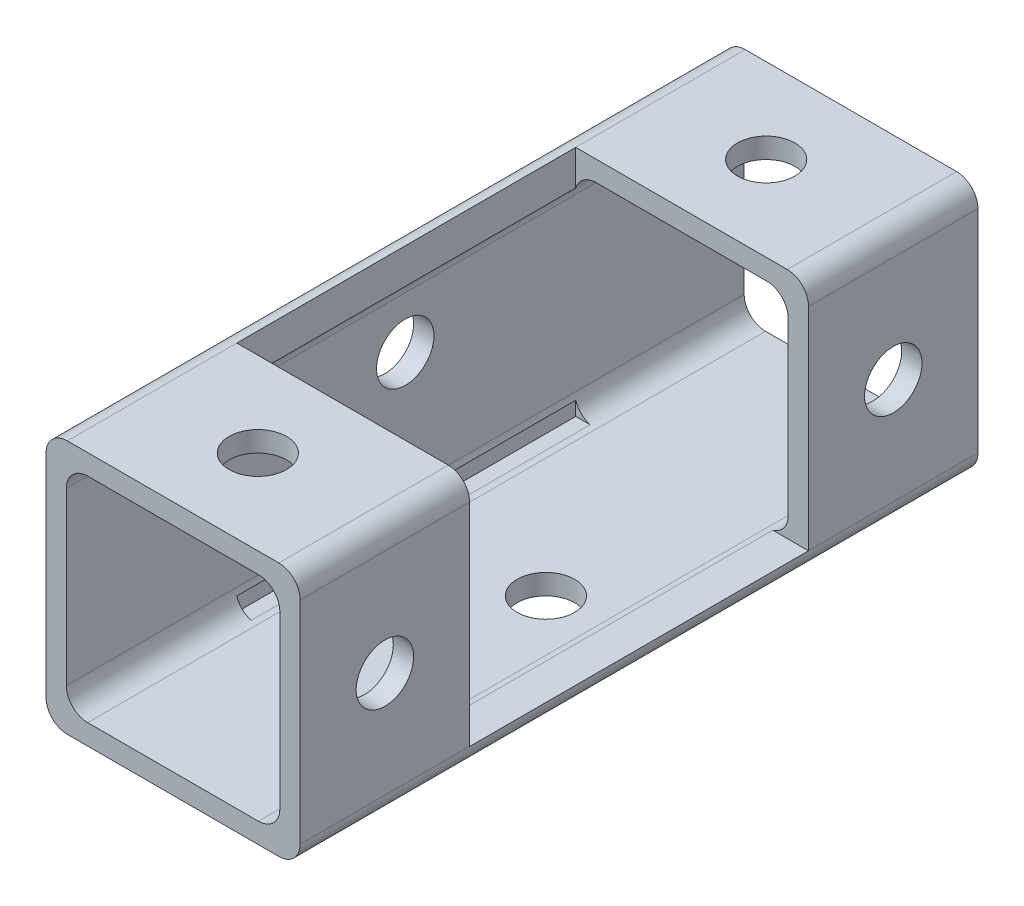
ISO-10303-21;
HEADER;
FILE_DESCRIPTION(('STEP AP214'),'2;1');
FILE_NAME('part.step','',(''),(''),'','','');
FILE_SCHEMA(('AUTOMOTIVE_DESIGN { 1 0 10303 214 1 1 1 1 }'));
ENDSEC;
DATA;
#1=APPLICATION_CONTEXT('core data for automotive mechanical design processes');
#2=APPLICATION_PROTOCOL_DEFINITION('international standard','automotive_design',2000,#1);
#3=PRODUCT_CONTEXT('',#1,'mechanical');
#4=PRODUCT('Part','Part','',(#3));
#5=PRODUCT_RELATED_PRODUCT_CATEGORY('part','',(#4));
#6=PRODUCT_DEFINITION_FORMATION('','',#4);
#7=PRODUCT_DEFINITION_CONTEXT('part definition',#1,'design');
#8=PRODUCT_DEFINITION('design','',#6,#7);
#9=PRODUCT_DEFINITION_SHAPE('','',#8);
#10=(LENGTH_UNIT() NAMED_UNIT(*) SI_UNIT(.MILLI.,.METRE.));
#11=(NAMED_UNIT(*) PLANE_ANGLE_UNIT() SI_UNIT($,.RADIAN.));
#12=(NAMED_UNIT(*) SI_UNIT($,.STERADIAN.) SOLID_ANGLE_UNIT());
#13=UNCERTAINTY_MEASURE_WITH_UNIT(LENGTH_MEASURE(1.E-05),#10,'distance_accuracy_value','');
#14=(GEOMETRIC_REPRESENTATION_CONTEXT(3) GLOBAL_UNCERTAINTY_ASSIGNED_CONTEXT((#13)) GLOBAL_UNIT_ASSIGNED_CONTEXT((#10,
#11,#12)) REPRESENTATION_CONTEXT('',''));
#15=CARTESIAN_POINT('',(0.,0.,0.));
#16=DIRECTION('',(0.,0.,1.));
#17=DIRECTION('',(1.,0.,0.));
#18=AXIS2_PLACEMENT_3D('',#15,#16,#17);
#19=CARTESIAN_POINT('',(9.525,-9.525,25.4));
#20=DIRECTION('',(-1.,0.,0.));
#21=DIRECTION('',(0.,0.,1.));
#22=AXIS2_PLACEMENT_3D('',#19,#20,#21);
#23=PLANE('',#22);
#24=CARTESIAN_POINT('',(9.525,0.,19.05));
#25=DIRECTION('',(1.,0.,0.));
#26=DIRECTION('',(0.,0.,-1.));
#27=AXIS2_PLACEMENT_3D('',#24,#25,#26);
#28=CIRCLE('',#27,2.15265);
#29=CARTESIAN_POINT('',(9.525,0.,16.89735));
#30=VERTEX_POINT('',#29);
#31=EDGE_CURVE('E471',#30,#30,#28,.T.);
#32=ORIENTED_EDGE('',*,*,#31,.F.);
#33=EDGE_LOOP('',(#32));
#34=FACE_BOUND('',#33,.T.);
#35=DIRECTION('',(0.,0.,-1.));
#36=VECTOR('',#35,1.);
#37=CARTESIAN_POINT('',(9.525,-7.9248,25.4));
#38=LINE('',#37,#36);
#39=CARTESIAN_POINT('',(9.525,-7.9248,25.4));
#40=VERTEX_POINT('',#39);
#41=CARTESIAN_POINT('',(9.525,-7.9248,12.7));
#42=VERTEX_POINT('',#41);
#43=EDGE_CURVE('E432',#40,#42,#38,.T.);
#44=ORIENTED_EDGE('',*,*,#43,.T.);
#45=DIRECTION('',(0.,1.,0.));
#46=VECTOR('',#45,1.);
#47=CARTESIAN_POINT('',(9.525,-9.525,12.7));
#48=LINE('',#47,#46);
#49=CARTESIAN_POINT('',(9.525,7.9248,12.7));
#50=VERTEX_POINT('',#49);
#51=EDGE_CURVE('E297',#42,#50,#48,.T.);
#52=ORIENTED_EDGE('',*,*,#51,.T.);
#53=DIRECTION('',(0.,0.,-1.));
#54=VECTOR('',#53,1.);
#55=CARTESIAN_POINT('',(9.525,7.9248,25.4));
#56=LINE('',#55,#54);
#57=CARTESIAN_POINT('',(9.525,7.92479999999999,25.4));
#58=VERTEX_POINT('',#57);
#59=EDGE_CURVE('E427',#50,#58,#56,.F.);
#60=ORIENTED_EDGE('',*,*,#59,.T.);
#61=DIRECTION('',(0.,1.,0.));
#62=VECTOR('',#61,1.);
#63=CARTESIAN_POINT('',(9.525,-9.525,25.4));
#64=LINE('',#63,#62);
#65=EDGE_CURVE('E363',#40,#58,#64,.T.);
#66=ORIENTED_EDGE('',*,*,#65,.F.);
#67=EDGE_LOOP('',(#44,#52,#60,#66));
#68=FACE_BOUND('',#67,.T.);
#69=ADVANCED_FACE('F43',(#34,#68),#23,.F.);
#70=CARTESIAN_POINT('',(-9.525,9.525,25.4));
#71=DIRECTION('',(0.,-1.,0.));
#72=DIRECTION('',(0.,0.,-1.));
#73=AXIS2_PLACEMENT_3D('',#70,#71,#72);
#74=PLANE('',#73);
#75=CARTESIAN_POINT('',(0.,9.525,19.05));
#76=DIRECTION('',(0.,1.,0.));
#77=DIRECTION('',(0.,0.,1.));
#78=AXIS2_PLACEMENT_3D('',#75,#76,#77);
#79=CIRCLE('',#78,2.15265);
#80=CARTESIAN_POINT('',(0.,9.525,21.20265));
#81=VERTEX_POINT('',#80);
#82=EDGE_CURVE('E482',#81,#81,#79,.T.);
#83=ORIENTED_EDGE('',*,*,#82,.F.);
#84=EDGE_LOOP('',(#83));
#85=FACE_BOUND('',#84,.T.);
#86=DIRECTION('',(0.,0.,-1.));
#87=VECTOR('',#86,1.);
#88=CARTESIAN_POINT('',(7.9248,9.525,25.4));
#89=LINE('',#88,#87);
#90=CARTESIAN_POINT('',(7.9248,9.525,25.4));
#91=VERTEX_POINT('',#90);
#92=CARTESIAN_POINT('',(7.9248,9.525,12.7));
#93=VERTEX_POINT('',#92);
#94=EDGE_CURVE('E436',#91,#93,#89,.T.);
#95=ORIENTED_EDGE('',*,*,#94,.T.);
#96=DIRECTION('',(1.,0.,0.));
#97=VECTOR('',#96,1.);
#98=CARTESIAN_POINT('',(-7.9248,9.525,12.7));
#99=LINE('',#98,#97);
#100=CARTESIAN_POINT('',(-7.9248,9.525,12.7));
#101=VERTEX_POINT('',#100);
#102=EDGE_CURVE('E250',#101,#93,#99,.T.);
#103=ORIENTED_EDGE('',*,*,#102,.F.);
#104=DIRECTION('',(0.,0.,-1.));
#105=VECTOR('',#104,1.);
#106=CARTESIAN_POINT('',(-7.9248,9.525,25.4));
#107=LINE('',#106,#105);
#108=CARTESIAN_POINT('',(-7.9248,9.525,25.4));
#109=VERTEX_POINT('',#108);
#110=EDGE_CURVE('E439',#101,#109,#107,.F.);
#111=ORIENTED_EDGE('',*,*,#110,.T.);
#112=DIRECTION('',(-1.,0.,0.));
#113=VECTOR('',#112,1.);
#114=CARTESIAN_POINT('',(-9.525,9.525,25.4));
#115=LINE('',#114,#113);
#116=EDGE_CURVE('E366',#91,#109,#115,.T.);
#117=ORIENTED_EDGE('',*,*,#116,.F.);
#118=EDGE_LOOP('',(#95,#103,#111,#117));
#119=FACE_BOUND('',#118,.T.);
#120=ADVANCED_FACE('F492',(#85,#119),#74,.F.);
#121=CARTESIAN_POINT('',(8.001,-8.001,25.4));
#122=DIRECTION('',(-1.,0.,0.));
#123=DIRECTION('',(0.,0.,1.));
#124=AXIS2_PLACEMENT_3D('',#121,#122,#123);
#125=PLANE('',#124);
#126=CARTESIAN_POINT('',(8.001,0.,19.05));
#127=DIRECTION('',(-1.,0.,0.));
#128=DIRECTION('',(0.,0.,1.));
#129=AXIS2_PLACEMENT_3D('',#126,#127,#128);
#130=CIRCLE('',#129,2.15265);
#131=CARTESIAN_POINT('',(8.001,0.,21.20265));
#132=VERTEX_POINT('',#131);
#133=EDGE_CURVE('E470',#132,#132,#130,.T.);
#134=ORIENTED_EDGE('',*,*,#133,.F.);
#135=EDGE_LOOP('',(#134));
#136=FACE_BOUND('',#135,.T.);
#137=DIRECTION('',(0.,1.,0.));
#138=VECTOR('',#137,1.);
#139=CARTESIAN_POINT('',(8.001,-8.001,12.7));
#140=LINE('',#139,#138);
#141=CARTESIAN_POINT('',(8.001,-6.4008,12.7));
#142=VERTEX_POINT('',#141);
#143=CARTESIAN_POINT('',(8.001,6.4008,12.7));
#144=VERTEX_POINT('',#143);
#145=EDGE_CURVE('E307',#142,#144,#140,.T.);
#146=ORIENTED_EDGE('',*,*,#145,.F.);
#147=DIRECTION('',(0.,0.,-1.));
#148=VECTOR('',#147,1.);
#149=CARTESIAN_POINT('',(8.001,-6.4008,25.4));
#150=LINE('',#149,#148);
#151=CARTESIAN_POINT('',(8.001,-6.4008,25.4));
#152=VERTEX_POINT('',#151);
#153=EDGE_CURVE('E389',#142,#152,#150,.F.);
#154=ORIENTED_EDGE('',*,*,#153,.T.);
#155=DIRECTION('',(0.,1.,0.));
#156=VECTOR('',#155,1.);
#157=CARTESIAN_POINT('',(8.001,-8.001,25.4));
#158=LINE('',#157,#156);
#159=CARTESIAN_POINT('',(8.001,6.4008,25.4));
#160=VERTEX_POINT('',#159);
#161=EDGE_CURVE('E351',#152,#160,#158,.T.);
#162=ORIENTED_EDGE('',*,*,#161,.T.);
#163=DIRECTION('',(0.,0.,-1.));
#164=VECTOR('',#163,1.);
#165=CARTESIAN_POINT('',(8.001,6.4008,-25.4));
#166=LINE('',#165,#164);
#167=EDGE_CURVE('E386',#160,#144,#166,.T.);
#168=ORIENTED_EDGE('',*,*,#167,.T.);
#169=EDGE_LOOP('',(#146,#154,#162,#168));
#170=FACE_BOUND('',#169,.T.);
#171=ADVANCED_FACE('F495',(#136,#170),#125,.T.);
#172=CARTESIAN_POINT('',(-8.001,8.001,25.4));
#173=DIRECTION('',(0.,-1.,0.));
#174=DIRECTION('',(0.,0.,-1.));
#175=AXIS2_PLACEMENT_3D('',#172,#173,#174);
#176=PLANE('',#175);
#177=CARTESIAN_POINT('',(0.,8.001,19.05));
#178=DIRECTION('',(0.,-1.,0.));
#179=DIRECTION('',(0.,0.,-1.));
#180=AXIS2_PLACEMENT_3D('',#177,#178,#179);
#181=CIRCLE('',#180,2.15265);
#182=CARTESIAN_POINT('',(0.,8.001,16.89735));
#183=VERTEX_POINT('',#182);
#184=EDGE_CURVE('E275',#183,#183,#181,.T.);
#185=ORIENTED_EDGE('',*,*,#184,.F.);
#186=EDGE_LOOP('',(#185));
#187=FACE_BOUND('',#186,.T.);
#188=DIRECTION('',(-1.,0.,0.));
#189=VECTOR('',#188,1.);
#190=CARTESIAN_POINT('',(-8.001,8.001,12.7));
#191=LINE('',#190,#189);
#192=CARTESIAN_POINT('',(6.4008,8.001,12.7));
#193=VERTEX_POINT('',#192);
#194=CARTESIAN_POINT('',(-6.4008,8.001,12.7));
#195=VERTEX_POINT('',#194);
#196=EDGE_CURVE('E305',#193,#195,#191,.T.);
#197=ORIENTED_EDGE('',*,*,#196,.F.);
#198=DIRECTION('',(0.,0.,-1.));
#199=VECTOR('',#198,1.);
#200=CARTESIAN_POINT('',(6.4008,8.001,25.4));
#201=LINE('',#200,#199);
#202=CARTESIAN_POINT('',(6.4008,8.001,25.4));
#203=VERTEX_POINT('',#202);
#204=EDGE_CURVE('E393',#193,#203,#201,.F.);
#205=ORIENTED_EDGE('',*,*,#204,.T.);
#206=DIRECTION('',(-1.,0.,0.));
#207=VECTOR('',#206,1.);
#208=CARTESIAN_POINT('',(-8.001,8.001,25.4));
#209=LINE('',#208,#207);
#210=CARTESIAN_POINT('',(-6.4008,8.001,25.4));
#211=VERTEX_POINT('',#210);
#212=EDGE_CURVE('E354',#203,#211,#209,.T.);
#213=ORIENTED_EDGE('',*,*,#212,.T.);
#214=DIRECTION('',(0.,0.,-1.));
#215=VECTOR('',#214,1.);
#216=CARTESIAN_POINT('',(-6.4008,8.001,-25.4));
#217=LINE('',#216,#215);
#218=EDGE_CURVE('E398',#211,#195,#217,.T.);
#219=ORIENTED_EDGE('',*,*,#218,.T.);
#220=EDGE_LOOP('',(#197,#205,#213,#219));
#221=FACE_BOUND('',#220,.T.);
#222=ADVANCED_FACE('F538',(#187,#221),#176,.T.);
#223=CARTESIAN_POINT('',(6.4008,6.4008,25.4));
#224=DIRECTION('',(0.,0.,1.));
#225=DIRECTION('',(1.,0.,0.));
#226=AXIS2_PLACEMENT_3D('',#223,#224,#225);
#227=CYLINDRICAL_SURFACE('',#226,1.6002);
#228=ORIENTED_EDGE('',*,*,#204,.F.);
#229=CARTESIAN_POINT('',(6.4008,6.4008,12.7));
#230=DIRECTION('',(0.,0.,1.));
#231=DIRECTION('',(1.,0.,0.));
#232=AXIS2_PLACEMENT_3D('',#229,#230,#231);
#233=CIRCLE('',#232,1.6002);
#234=EDGE_CURVE('E302',#193,#144,#233,.F.);
#235=ORIENTED_EDGE('',*,*,#234,.T.);
#236=ORIENTED_EDGE('',*,*,#167,.F.);
#237=CARTESIAN_POINT('',(6.4008,6.4008,25.4));
#238=DIRECTION('',(0.,0.,-1.));
#239=DIRECTION('',(-1.,0.,0.));
#240=AXIS2_PLACEMENT_3D('',#237,#238,#239);
#241=CIRCLE('',#240,1.6002);
#242=EDGE_CURVE('E457',#203,#160,#241,.T.);
#243=ORIENTED_EDGE('',*,*,#242,.F.);
#244=EDGE_LOOP('',(#228,#235,#236,#243));
#245=FACE_BOUND('',#244,.T.);
#246=ADVANCED_FACE('F535',(#245),#227,.F.);
#247=CARTESIAN_POINT('',(7.9248,7.9248,25.4));
#248=DIRECTION('',(0.,0.,-1.));
#249=DIRECTION('',(-1.,0.,0.));
#250=AXIS2_PLACEMENT_3D('',#247,#248,#249);
#251=CYLINDRICAL_SURFACE('',#250,1.6002);
#252=CARTESIAN_POINT('',(7.9248,7.9248,12.7));
#253=DIRECTION('',(0.,0.,1.));
#254=DIRECTION('',(1.,0.,0.));
#255=AXIS2_PLACEMENT_3D('',#252,#253,#254);
#256=CIRCLE('',#255,1.6002);
#257=EDGE_CURVE('E52',#93,#50,#256,.F.);
#258=ORIENTED_EDGE('',*,*,#257,.F.);
#259=ORIENTED_EDGE('',*,*,#94,.F.);
#260=CARTESIAN_POINT('',(7.9248,7.9248,25.4));
#261=DIRECTION('',(0.,0.,-1.));
#262=DIRECTION('',(-1.,0.,0.));
#263=AXIS2_PLACEMENT_3D('',#260,#261,#262);
#264=CIRCLE('',#263,1.6002);
#265=EDGE_CURVE('E419',#58,#91,#264,.F.);
#266=ORIENTED_EDGE('',*,*,#265,.F.);
#267=ORIENTED_EDGE('',*,*,#59,.F.);
#268=EDGE_LOOP('',(#258,#259,#266,#267));
#269=FACE_BOUND('',#268,.T.);
#270=ADVANCED_FACE('F505',(#269),#251,.T.);
#271=CARTESIAN_POINT('',(0.,0.,25.4));
#272=DIRECTION('',(0.,0.,-1.));
#273=DIRECTION('',(-1.,0.,0.));
#274=AXIS2_PLACEMENT_3D('',#271,#272,#273);
#275=PLANE('',#274);
#276=DIRECTION('',(0.,-1.,0.));
#277=VECTOR('',#276,1.);
#278=CARTESIAN_POINT('',(-9.525,-9.525,25.4));
#279=LINE('',#278,#277);
#280=CARTESIAN_POINT('',(-9.525,7.92479999999999,25.4));
#281=VERTEX_POINT('',#280);
#282=CARTESIAN_POINT('',(-9.525,-7.9248,25.4));
#283=VERTEX_POINT('',#282);
#284=EDGE_CURVE('E369',#281,#283,#279,.T.);
#285=ORIENTED_EDGE('',*,*,#284,.T.);
#286=CARTESIAN_POINT('',(-7.9248,-7.9248,25.4));
#287=DIRECTION('',(0.,0.,-1.));
#288=DIRECTION('',(-1.,0.,0.));
#289=AXIS2_PLACEMENT_3D('',#286,#287,#288);
#290=CIRCLE('',#289,1.6002);
#291=CARTESIAN_POINT('',(-7.9248,-9.525,25.4));
#292=VERTEX_POINT('',#291);
#293=EDGE_CURVE('E425',#283,#292,#290,.F.);
#294=ORIENTED_EDGE('',*,*,#293,.T.);
#295=DIRECTION('',(1.,0.,0.));
#296=VECTOR('',#295,1.);
#297=CARTESIAN_POINT('',(-9.525,-9.525,25.4));
#298=LINE('',#297,#296);
#299=CARTESIAN_POINT('',(7.9248,-9.525,25.4));
#300=VERTEX_POINT('',#299);
#301=EDGE_CURVE('E372',#292,#300,#298,.T.);
#302=ORIENTED_EDGE('',*,*,#301,.T.);
#303=CARTESIAN_POINT('',(7.9248,-7.9248,25.4));
#304=DIRECTION('',(0.,0.,-1.));
#305=DIRECTION('',(-1.,0.,0.));
#306=AXIS2_PLACEMENT_3D('',#303,#304,#305);
#307=CIRCLE('',#306,1.6002);
#308=EDGE_CURVE('E423',#300,#40,#307,.F.);
#309=ORIENTED_EDGE('',*,*,#308,.T.);
#310=ORIENTED_EDGE('',*,*,#65,.T.);
#311=ORIENTED_EDGE('',*,*,#265,.T.);
#312=ORIENTED_EDGE('',*,*,#116,.T.);
#313=CARTESIAN_POINT('',(-7.9248,7.9248,25.4));
#314=DIRECTION('',(0.,0.,-1.));
#315=DIRECTION('',(-1.,0.,0.));
#316=AXIS2_PLACEMENT_3D('',#313,#314,#315);
#317=CIRCLE('',#316,1.6002);
#318=EDGE_CURVE('E421',#109,#281,#317,.F.);
#319=ORIENTED_EDGE('',*,*,#318,.T.);
#320=EDGE_LOOP('',(#285,#294,#302,#309,#310,#311,#312,#319));
#321=FACE_BOUND('',#320,.T.);
#322=ORIENTED_EDGE('',*,*,#161,.F.);
#323=CARTESIAN_POINT('',(6.4008,-6.4008,25.4));
#324=DIRECTION('',(0.,0.,-1.));
#325=DIRECTION('',(-1.,0.,0.));
#326=AXIS2_PLACEMENT_3D('',#323,#324,#325);
#327=CIRCLE('',#326,1.6002);
#328=CARTESIAN_POINT('',(6.4008,-8.001,25.4));
#329=VERTEX_POINT('',#328);
#330=EDGE_CURVE('E449',#152,#329,#327,.T.);
#331=ORIENTED_EDGE('',*,*,#330,.T.);
#332=DIRECTION('',(1.,0.,0.));
#333=VECTOR('',#332,1.);
#334=CARTESIAN_POINT('',(-8.001,-8.001,25.4));
#335=LINE('',#334,#333);
#336=CARTESIAN_POINT('',(-6.4008,-8.001,25.4));
#337=VERTEX_POINT('',#336);
#338=EDGE_CURVE('E360',#337,#329,#335,.T.);
#339=ORIENTED_EDGE('',*,*,#338,.F.);
#340=CARTESIAN_POINT('',(-6.4008,-6.4008,25.4));
#341=DIRECTION('',(0.,0.,-1.));
#342=DIRECTION('',(-1.,0.,0.));
#343=AXIS2_PLACEMENT_3D('',#340,#341,#342);
#344=CIRCLE('',#343,1.6002);
#345=CARTESIAN_POINT('',(-8.001,-6.4008,25.4));
#346=VERTEX_POINT('',#345);
#347=EDGE_CURVE('E445',#337,#346,#344,.T.);
#348=ORIENTED_EDGE('',*,*,#347,.T.);
#349=DIRECTION('',(0.,-1.,0.));
#350=VECTOR('',#349,1.);
#351=CARTESIAN_POINT('',(-8.001,-8.001,25.4));
#352=LINE('',#351,#350);
#353=CARTESIAN_POINT('',(-8.001,6.4008,25.4));
#354=VERTEX_POINT('',#353);
#355=EDGE_CURVE('E357',#354,#346,#352,.T.);
#356=ORIENTED_EDGE('',*,*,#355,.F.);
#357=CARTESIAN_POINT('',(-6.4008,6.4008,25.4));
#358=DIRECTION('',(0.,0.,-1.));
#359=DIRECTION('',(-1.,0.,0.));
#360=AXIS2_PLACEMENT_3D('',#357,#358,#359);
#361=CIRCLE('',#360,1.6002);
#362=EDGE_CURVE('E453',#354,#211,#361,.T.);
#363=ORIENTED_EDGE('',*,*,#362,.T.);
#364=ORIENTED_EDGE('',*,*,#212,.F.);
#365=ORIENTED_EDGE('',*,*,#242,.T.);
#366=EDGE_LOOP('',(#322,#331,#339,#348,#356,#363,#364,#365));
#367=FACE_BOUND('',#366,.T.);
#368=ADVANCED_FACE('F571',(#321,#367),#275,.F.);
#369=CARTESIAN_POINT('',(9.525,0.,-19.05));
#370=DIRECTION('',(1.,0.,0.));
#371=DIRECTION('',(0.,0.,-1.));
#372=AXIS2_PLACEMENT_3D('',#369,#370,#371);
#373=CIRCLE('',#372,2.15265);
#374=CARTESIAN_POINT('',(9.525,0.,-21.20265));
#375=VERTEX_POINT('',#374);
#376=EDGE_CURVE('E612',#375,#375,#373,.T.);
#377=ORIENTED_EDGE('',*,*,#376,.F.);
#378=EDGE_LOOP('',(#377));
#379=FACE_BOUND('',#378,.T.);
#380=CARTESIAN_POINT('',(9.525,7.92479999999999,-25.4));
#381=VERTEX_POINT('',#380);
#382=CARTESIAN_POINT('',(9.525,7.9248,-12.7));
#383=VERTEX_POINT('',#382);
#384=EDGE_CURVE('E428',#381,#383,#56,.F.);
#385=ORIENTED_EDGE('',*,*,#384,.T.);
#386=DIRECTION('',(0.,-1.,0.));
#387=VECTOR('',#386,1.);
#388=CARTESIAN_POINT('',(9.525,-9.525,-12.7));
#389=LINE('',#388,#387);
#390=CARTESIAN_POINT('',(9.525,-7.9248,-12.7));
#391=VERTEX_POINT('',#390);
#392=EDGE_CURVE('E279',#383,#391,#389,.T.);
#393=ORIENTED_EDGE('',*,*,#392,.T.);
#394=CARTESIAN_POINT('',(9.525,-7.9248,-25.4));
#395=VERTEX_POINT('',#394);
#396=EDGE_CURVE('E431',#391,#395,#38,.T.);
#397=ORIENTED_EDGE('',*,*,#396,.T.);
#398=DIRECTION('',(0.,1.,0.));
#399=VECTOR('',#398,1.);
#400=CARTESIAN_POINT('',(9.525,-9.525,-25.4));
#401=LINE('',#400,#399);
#402=EDGE_CURVE('E339',#395,#381,#401,.T.);
#403=ORIENTED_EDGE('',*,*,#402,.T.);
#404=EDGE_LOOP('',(#385,#393,#397,#403));
#405=FACE_BOUND('',#404,.T.);
#406=ADVANCED_FACE('F582',(#379,#405),#23,.F.);
#407=CARTESIAN_POINT('',(0.,9.525,-19.05));
#408=DIRECTION('',(0.,1.,0.));
#409=DIRECTION('',(0.,0.,1.));
#410=AXIS2_PLACEMENT_3D('',#407,#408,#409);
#411=CIRCLE('',#410,2.15265);
#412=CARTESIAN_POINT('',(0.,9.525,-16.89735));
#413=VERTEX_POINT('',#412);
#414=EDGE_CURVE('E465',#413,#413,#411,.T.);
#415=ORIENTED_EDGE('',*,*,#414,.F.);
#416=EDGE_LOOP('',(#415));
#417=FACE_BOUND('',#416,.T.);
#418=CARTESIAN_POINT('',(-7.9248,9.525,-25.4));
#419=VERTEX_POINT('',#418);
#420=CARTESIAN_POINT('',(-7.9248,9.525,-12.7));
#421=VERTEX_POINT('',#420);
#422=EDGE_CURVE('E440',#419,#421,#107,.F.);
#423=ORIENTED_EDGE('',*,*,#422,.T.);
#424=DIRECTION('',(-1.,0.,0.));
#425=VECTOR('',#424,1.);
#426=CARTESIAN_POINT('',(-7.9248,9.525,-12.7));
#427=LINE('',#426,#425);
#428=CARTESIAN_POINT('',(7.9248,9.525,-12.7));
#429=VERTEX_POINT('',#428);
#430=EDGE_CURVE('E271',#429,#421,#427,.T.);
#431=ORIENTED_EDGE('',*,*,#430,.F.);
#432=CARTESIAN_POINT('',(7.9248,9.525,-25.4));
#433=VERTEX_POINT('',#432);
#434=EDGE_CURVE('E435',#429,#433,#89,.T.);
#435=ORIENTED_EDGE('',*,*,#434,.T.);
#436=DIRECTION('',(-1.,0.,0.));
#437=VECTOR('',#436,1.);
#438=CARTESIAN_POINT('',(-9.525,9.525,-25.4));
#439=LINE('',#438,#437);
#440=EDGE_CURVE('E342',#433,#419,#439,.T.);
#441=ORIENTED_EDGE('',*,*,#440,.T.);
#442=EDGE_LOOP('',(#423,#431,#435,#441));
#443=FACE_BOUND('',#442,.T.);
#444=ADVANCED_FACE('F497',(#417,#443),#74,.F.);
#445=CARTESIAN_POINT('',(-9.525,-9.525,25.4));
#446=DIRECTION('',(1.,0.,0.));
#447=DIRECTION('',(0.,0.,-1.));
#448=AXIS2_PLACEMENT_3D('',#445,#446,#447);
#449=PLANE('',#448);
#450=CARTESIAN_POINT('',(-9.525,2.54,0.));
#451=DIRECTION('',(1.,0.,0.));
#452=DIRECTION('',(0.,0.,-1.));
#453=AXIS2_PLACEMENT_3D('',#450,#451,#452);
#454=CIRCLE('',#453,2.15265);
#455=CARTESIAN_POINT('',(-9.525,2.54,-2.15265));
#456=VERTEX_POINT('',#455);
#457=EDGE_CURVE('E617',#456,#456,#454,.T.);
#458=ORIENTED_EDGE('',*,*,#457,.T.);
#459=EDGE_LOOP('',(#458));
#460=FACE_BOUND('',#459,.T.);
#461=DIRECTION('',(0.,-1.,0.));
#462=VECTOR('',#461,1.);
#463=CARTESIAN_POINT('',(-9.525,-9.525,-25.4));
#464=LINE('',#463,#462);
#465=CARTESIAN_POINT('',(-9.525,7.92479999999999,-25.4));
#466=VERTEX_POINT('',#465);
#467=CARTESIAN_POINT('',(-9.525,-7.9248,-25.4));
#468=VERTEX_POINT('',#467);
#469=EDGE_CURVE('E345',#466,#468,#464,.T.);
#470=ORIENTED_EDGE('',*,*,#469,.T.);
#471=DIRECTION('',(0.,0.,-1.));
#472=VECTOR('',#471,1.);
#473=CARTESIAN_POINT('',(-9.525,-7.9248,25.4));
#474=LINE('',#473,#472);
#475=EDGE_CURVE('E417',#468,#283,#474,.F.);
#476=ORIENTED_EDGE('',*,*,#475,.T.);
#477=ORIENTED_EDGE('',*,*,#284,.F.);
#478=DIRECTION('',(0.,0.,-1.));
#479=VECTOR('',#478,1.);
#480=CARTESIAN_POINT('',(-9.525,7.9248,25.4));
#481=LINE('',#480,#479);
#482=EDGE_CURVE('E414',#281,#466,#481,.T.);
#483=ORIENTED_EDGE('',*,*,#482,.T.);
#484=EDGE_LOOP('',(#470,#476,#477,#483));
#485=FACE_BOUND('',#484,.T.);
#486=ADVANCED_FACE('F567',(#460,#485),#449,.F.);
#487=CARTESIAN_POINT('',(-9.525,-9.525,25.4));
#488=DIRECTION('',(0.,1.,0.));
#489=DIRECTION('',(0.,0.,1.));
#490=AXIS2_PLACEMENT_3D('',#487,#488,#489);
#491=PLANE('',#490);
#492=CARTESIAN_POINT('',(2.54,-9.525,0.));
#493=DIRECTION('',(0.,1.,0.));
#494=DIRECTION('',(0.,0.,1.));
#495=AXIS2_PLACEMENT_3D('',#492,#493,#494);
#496=CIRCLE('',#495,2.15265);
#497=CARTESIAN_POINT('',(2.54,-9.525,2.15265));
#498=VERTEX_POINT('',#497);
#499=EDGE_CURVE('E477',#498,#498,#496,.T.);
#500=ORIENTED_EDGE('',*,*,#499,.T.);
#501=EDGE_LOOP('',(#500));
#502=FACE_BOUND('',#501,.T.);
#503=ORIENTED_EDGE('',*,*,#301,.F.);
#504=DIRECTION('',(0.,0.,-1.));
#505=VECTOR('',#504,1.);
#506=CARTESIAN_POINT('',(-7.9248,-9.525,25.4));
#507=LINE('',#506,#505);
#508=CARTESIAN_POINT('',(-7.9248,-9.525,-25.4));
#509=VERTEX_POINT('',#508);
#510=EDGE_CURVE('E403',#292,#509,#507,.T.);
#511=ORIENTED_EDGE('',*,*,#510,.T.);
#512=DIRECTION('',(1.,0.,0.));
#513=VECTOR('',#512,1.);
#514=CARTESIAN_POINT('',(-9.525,-9.525,-25.4));
#515=LINE('',#514,#513);
#516=CARTESIAN_POINT('',(7.9248,-9.525,-25.4));
#517=VERTEX_POINT('',#516);
#518=EDGE_CURVE('E348',#509,#517,#515,.T.);
#519=ORIENTED_EDGE('',*,*,#518,.T.);
#520=DIRECTION('',(0.,0.,-1.));
#521=VECTOR('',#520,1.);
#522=CARTESIAN_POINT('',(7.9248,-9.525,25.4));
#523=LINE('',#522,#521);
#524=EDGE_CURVE('E401',#517,#300,#523,.F.);
#525=ORIENTED_EDGE('',*,*,#524,.T.);
#526=EDGE_LOOP('',(#503,#511,#519,#525));
#527=FACE_BOUND('',#526,.T.);
#528=ADVANCED_FACE('F578',(#502,#527),#491,.F.);
#529=CARTESIAN_POINT('',(8.001,0.,-19.05));
#530=DIRECTION('',(-1.,0.,0.));
#531=DIRECTION('',(0.,0.,1.));
#532=AXIS2_PLACEMENT_3D('',#529,#530,#531);
#533=CIRCLE('',#532,2.15265);
#534=CARTESIAN_POINT('',(8.001,0.,-16.89735));
#535=VERTEX_POINT('',#534);
#536=EDGE_CURVE('E468',#535,#535,#533,.T.);
#537=ORIENTED_EDGE('',*,*,#536,.F.);
#538=EDGE_LOOP('',(#537));
#539=FACE_BOUND('',#538,.T.);
#540=DIRECTION('',(0.,-1.,0.));
#541=VECTOR('',#540,1.);
#542=CARTESIAN_POINT('',(8.001,-8.001,-12.7));
#543=LINE('',#542,#541);
#544=CARTESIAN_POINT('',(8.001,6.4008,-12.7));
#545=VERTEX_POINT('',#544);
#546=CARTESIAN_POINT('',(8.001,-6.4008,-12.7));
#547=VERTEX_POINT('',#546);
#548=EDGE_CURVE('E288',#545,#547,#543,.T.);
#549=ORIENTED_EDGE('',*,*,#548,.F.);
#550=CARTESIAN_POINT('',(8.001,6.4008,-25.4));
#551=VERTEX_POINT('',#550);
#552=EDGE_CURVE('E385',#545,#551,#166,.T.);
#553=ORIENTED_EDGE('',*,*,#552,.T.);
#554=DIRECTION('',(0.,1.,0.));
#555=VECTOR('',#554,1.);
#556=CARTESIAN_POINT('',(8.001,-8.001,-25.4));
#557=LINE('',#556,#555);
#558=CARTESIAN_POINT('',(8.001,-6.4008,-25.4));
#559=VERTEX_POINT('',#558);
#560=EDGE_CURVE('E327',#559,#551,#557,.T.);
#561=ORIENTED_EDGE('',*,*,#560,.F.);
#562=EDGE_CURVE('E390',#559,#547,#150,.F.);
#563=ORIENTED_EDGE('',*,*,#562,.T.);
#564=EDGE_LOOP('',(#549,#553,#561,#563));
#565=FACE_BOUND('',#564,.T.);
#566=ADVANCED_FACE('F671',(#539,#565),#125,.T.);
#567=CARTESIAN_POINT('',(0.,8.001,-19.05));
#568=DIRECTION('',(0.,-1.,0.));
#569=DIRECTION('',(0.,0.,-1.));
#570=AXIS2_PLACEMENT_3D('',#567,#568,#569);
#571=CIRCLE('',#570,2.15265);
#572=CARTESIAN_POINT('',(0.,8.001,-21.20265));
#573=VERTEX_POINT('',#572);
#574=EDGE_CURVE('E462',#573,#573,#571,.T.);
#575=ORIENTED_EDGE('',*,*,#574,.F.);
#576=EDGE_LOOP('',(#575));
#577=FACE_BOUND('',#576,.T.);
#578=DIRECTION('',(1.,0.,0.));
#579=VECTOR('',#578,1.);
#580=CARTESIAN_POINT('',(-8.001,8.001,-12.7));
#581=LINE('',#580,#579);
#582=CARTESIAN_POINT('',(-6.4008,8.001,-12.7));
#583=VERTEX_POINT('',#582);
#584=CARTESIAN_POINT('',(6.4008,8.001,-12.7));
#585=VERTEX_POINT('',#584);
#586=EDGE_CURVE('E68',#583,#585,#581,.T.);
#587=ORIENTED_EDGE('',*,*,#586,.F.);
#588=CARTESIAN_POINT('',(-6.4008,8.001,-25.4));
#589=VERTEX_POINT('',#588);
#590=EDGE_CURVE('E397',#583,#589,#217,.T.);
#591=ORIENTED_EDGE('',*,*,#590,.T.);
#592=DIRECTION('',(-1.,0.,0.));
#593=VECTOR('',#592,1.);
#594=CARTESIAN_POINT('',(-8.001,8.001,-25.4));
#595=LINE('',#594,#593);
#596=CARTESIAN_POINT('',(6.4008,8.001,-25.4));
#597=VERTEX_POINT('',#596);
#598=EDGE_CURVE('E330',#597,#589,#595,.T.);
#599=ORIENTED_EDGE('',*,*,#598,.F.);
#600=EDGE_CURVE('E394',#597,#585,#201,.F.);
#601=ORIENTED_EDGE('',*,*,#600,.T.);
#602=EDGE_LOOP('',(#587,#591,#599,#601));
#603=FACE_BOUND('',#602,.T.);
#604=ADVANCED_FACE('F667',(#577,#603),#176,.T.);
#605=CARTESIAN_POINT('',(-8.001,-8.001,25.4));
#606=DIRECTION('',(1.,0.,0.));
#607=DIRECTION('',(0.,0.,-1.));
#608=AXIS2_PLACEMENT_3D('',#605,#606,#607);
#609=PLANE('',#608);
#610=CARTESIAN_POINT('',(-8.001,2.54,0.));
#611=DIRECTION('',(1.,0.,0.));
#612=DIRECTION('',(0.,0.,-1.));
#613=AXIS2_PLACEMENT_3D('',#610,#611,#612);
#614=CIRCLE('',#613,2.15265);
#615=CARTESIAN_POINT('',(-8.001,2.54,-2.15265));
#616=VERTEX_POINT('',#615);
#617=EDGE_CURVE('E47',#616,#616,#614,.T.);
#618=ORIENTED_EDGE('',*,*,#617,.F.);
#619=EDGE_LOOP('',(#618));
#620=FACE_BOUND('',#619,.T.);
#621=ORIENTED_EDGE('',*,*,#355,.T.);
#622=DIRECTION('',(0.,0.,-1.));
#623=VECTOR('',#622,1.);
#624=CARTESIAN_POINT('',(-8.001,-6.4008,-25.4));
#625=LINE('',#624,#623);
#626=CARTESIAN_POINT('',(-8.001,-6.4008,-25.4));
#627=VERTEX_POINT('',#626);
#628=EDGE_CURVE('E377',#346,#627,#625,.T.);
#629=ORIENTED_EDGE('',*,*,#628,.T.);
#630=DIRECTION('',(0.,-1.,0.));
#631=VECTOR('',#630,1.);
#632=CARTESIAN_POINT('',(-8.001,-8.001,-25.4));
#633=LINE('',#632,#631);
#634=CARTESIAN_POINT('',(-8.001,6.4008,-25.4));
#635=VERTEX_POINT('',#634);
#636=EDGE_CURVE('E333',#635,#627,#633,.T.);
#637=ORIENTED_EDGE('',*,*,#636,.F.);
#638=DIRECTION('',(0.,0.,-1.));
#639=VECTOR('',#638,1.);
#640=CARTESIAN_POINT('',(-8.001,6.4008,25.4));
#641=LINE('',#640,#639);
#642=EDGE_CURVE('E375',#635,#354,#641,.F.);
#643=ORIENTED_EDGE('',*,*,#642,.T.);
#644=EDGE_LOOP('',(#621,#629,#637,#643));
#645=FACE_BOUND('',#644,.T.);
#646=ADVANCED_FACE('F663',(#620,#645),#609,.T.);
#647=CARTESIAN_POINT('',(-8.001,-8.001,25.4));
#648=DIRECTION('',(0.,1.,0.));
#649=DIRECTION('',(0.,0.,1.));
#650=AXIS2_PLACEMENT_3D('',#647,#648,#649);
#651=PLANE('',#650);
#652=CARTESIAN_POINT('',(2.54,-8.001,0.));
#653=DIRECTION('',(0.,1.,0.));
#654=DIRECTION('',(0.,0.,1.));
#655=AXIS2_PLACEMENT_3D('',#652,#653,#654);
#656=CIRCLE('',#655,2.15265);
#657=CARTESIAN_POINT('',(2.54,-8.001,2.15265));
#658=VERTEX_POINT('',#657);
#659=EDGE_CURVE('E473',#658,#658,#656,.T.);
#660=ORIENTED_EDGE('',*,*,#659,.F.);
#661=EDGE_LOOP('',(#660));
#662=FACE_BOUND('',#661,.T.);
#663=DIRECTION('',(1.,0.,0.));
#664=VECTOR('',#663,1.);
#665=CARTESIAN_POINT('',(-8.001,-8.001,-25.4));
#666=LINE('',#665,#664);
#667=CARTESIAN_POINT('',(-6.4008,-8.001,-25.4));
#668=VERTEX_POINT('',#667);
#669=CARTESIAN_POINT('',(6.4008,-8.001,-25.4));
#670=VERTEX_POINT('',#669);
#671=EDGE_CURVE('E336',#668,#670,#666,.T.);
#672=ORIENTED_EDGE('',*,*,#671,.F.);
#673=DIRECTION('',(0.,0.,-1.));
#674=VECTOR('',#673,1.);
#675=CARTESIAN_POINT('',(-6.4008,-8.001,25.4));
#676=LINE('',#675,#674);
#677=EDGE_CURVE('E383',#668,#337,#676,.F.);
#678=ORIENTED_EDGE('',*,*,#677,.T.);
#679=ORIENTED_EDGE('',*,*,#338,.T.);
#680=DIRECTION('',(0.,0.,-1.));
#681=VECTOR('',#680,1.);
#682=CARTESIAN_POINT('',(6.4008,-8.001,-25.4));
#683=LINE('',#682,#681);
#684=EDGE_CURVE('E380',#329,#670,#683,.T.);
#685=ORIENTED_EDGE('',*,*,#684,.T.);
#686=EDGE_LOOP('',(#672,#678,#679,#685));
#687=FACE_BOUND('',#686,.T.);
#688=ADVANCED_FACE('F659',(#662,#687),#651,.T.);
#689=CARTESIAN_POINT('',(0.,0.,-25.4));
#690=DIRECTION('',(0.,0.,-1.));
#691=DIRECTION('',(-1.,0.,0.));
#692=AXIS2_PLACEMENT_3D('',#689,#690,#691);
#693=PLANE('',#692);
#694=ORIENTED_EDGE('',*,*,#671,.T.);
#695=CARTESIAN_POINT('',(6.4008,-6.4008,-25.4));
#696=DIRECTION('',(0.,0.,-1.));
#697=DIRECTION('',(-1.,0.,0.));
#698=AXIS2_PLACEMENT_3D('',#695,#696,#697);
#699=CIRCLE('',#698,1.6002);
#700=EDGE_CURVE('E447',#670,#559,#699,.F.);
#701=ORIENTED_EDGE('',*,*,#700,.T.);
#702=ORIENTED_EDGE('',*,*,#560,.T.);
#703=CARTESIAN_POINT('',(6.4008,6.4008,-25.4));
#704=DIRECTION('',(0.,0.,-1.));
#705=DIRECTION('',(-1.,0.,0.));
#706=AXIS2_PLACEMENT_3D('',#703,#704,#705);
#707=CIRCLE('',#706,1.6002);
#708=EDGE_CURVE('E455',#551,#597,#707,.F.);
#709=ORIENTED_EDGE('',*,*,#708,.T.);
#710=ORIENTED_EDGE('',*,*,#598,.T.);
#711=CARTESIAN_POINT('',(-6.4008,6.4008,-25.4));
#712=DIRECTION('',(0.,0.,-1.));
#713=DIRECTION('',(-1.,0.,0.));
#714=AXIS2_PLACEMENT_3D('',#711,#712,#713);
#715=CIRCLE('',#714,1.6002);
#716=EDGE_CURVE('E451',#589,#635,#715,.F.);
#717=ORIENTED_EDGE('',*,*,#716,.T.);
#718=ORIENTED_EDGE('',*,*,#636,.T.);
#719=CARTESIAN_POINT('',(-6.4008,-6.4008,-25.4));
#720=DIRECTION('',(0.,0.,-1.));
#721=DIRECTION('',(-1.,0.,0.));
#722=AXIS2_PLACEMENT_3D('',#719,#720,#721);
#723=CIRCLE('',#722,1.6002);
#724=EDGE_CURVE('E443',#627,#668,#723,.F.);
#725=ORIENTED_EDGE('',*,*,#724,.T.);
#726=EDGE_LOOP('',(#694,#701,#702,#709,#710,#717,#718,#725));
#727=FACE_BOUND('',#726,.T.);
#728=ORIENTED_EDGE('',*,*,#518,.F.);
#729=CARTESIAN_POINT('',(-7.9248,-7.9248,-25.4));
#730=DIRECTION('',(0.,0.,-1.));
#731=DIRECTION('',(-1.,0.,0.));
#732=AXIS2_PLACEMENT_3D('',#729,#730,#731);
#733=CIRCLE('',#732,1.6002);
#734=EDGE_CURVE('E412',#509,#468,#733,.T.);
#735=ORIENTED_EDGE('',*,*,#734,.T.);
#736=ORIENTED_EDGE('',*,*,#469,.F.);
#737=CARTESIAN_POINT('',(-7.9248,7.9248,-25.4));
#738=DIRECTION('',(0.,0.,-1.));
#739=DIRECTION('',(-1.,0.,0.));
#740=AXIS2_PLACEMENT_3D('',#737,#738,#739);
#741=CIRCLE('',#740,1.6002);
#742=EDGE_CURVE('E408',#466,#419,#741,.T.);
#743=ORIENTED_EDGE('',*,*,#742,.T.);
#744=ORIENTED_EDGE('',*,*,#440,.F.);
#745=CARTESIAN_POINT('',(7.9248,7.9248,-25.4));
#746=DIRECTION('',(0.,0.,-1.));
#747=DIRECTION('',(-1.,0.,0.));
#748=AXIS2_PLACEMENT_3D('',#745,#746,#747);
#749=CIRCLE('',#748,1.6002);
#750=EDGE_CURVE('E406',#433,#381,#749,.T.);
#751=ORIENTED_EDGE('',*,*,#750,.T.);
#752=ORIENTED_EDGE('',*,*,#402,.F.);
#753=CARTESIAN_POINT('',(7.9248,-7.9248,-25.4));
#754=DIRECTION('',(0.,0.,-1.));
#755=DIRECTION('',(-1.,0.,0.));
#756=AXIS2_PLACEMENT_3D('',#753,#754,#755);
#757=CIRCLE('',#756,1.6002);
#758=EDGE_CURVE('E410',#395,#517,#757,.T.);
#759=ORIENTED_EDGE('',*,*,#758,.T.);
#760=EDGE_LOOP('',(#728,#735,#736,#743,#744,#751,#752,#759));
#761=FACE_BOUND('',#760,.T.);
#762=ADVANCED_FACE('F561',(#727,#761),#693,.T.);
#763=CARTESIAN_POINT('',(-6.4008,-6.4008,25.4));
#764=DIRECTION('',(0.,0.,1.));
#765=DIRECTION('',(1.,0.,0.));
#766=AXIS2_PLACEMENT_3D('',#763,#764,#765);
#767=CYLINDRICAL_SURFACE('',#766,1.6002);
#768=DIRECTION('',(0.,0.,1.));
#769=VECTOR('',#768,1.);
#770=CARTESIAN_POINT('',(-6.84711059812647,-7.9375,25.4));
#771=LINE('',#770,#769);
#772=CARTESIAN_POINT('',(-6.84711059812647,-7.9375,-12.7));
#773=VERTEX_POINT('',#772);
#774=CARTESIAN_POINT('',(-6.84711059812647,-7.9375,12.7));
#775=VERTEX_POINT('',#774);
#776=EDGE_CURVE('E246',#773,#775,#771,.T.);
#777=ORIENTED_EDGE('',*,*,#776,.T.);
#778=CARTESIAN_POINT('',(-6.4008,-6.4008,12.7));
#779=DIRECTION('',(0.,0.,1.));
#780=DIRECTION('',(1.,0.,0.));
#781=AXIS2_PLACEMENT_3D('',#778,#779,#780);
#782=CIRCLE('',#781,1.6002);
#783=CARTESIAN_POINT('',(-7.9248,-6.88871806689238,12.7));
#784=VERTEX_POINT('',#783);
#785=EDGE_CURVE('E315',#775,#784,#782,.F.);
#786=ORIENTED_EDGE('',*,*,#785,.T.);
#787=DIRECTION('',(0.,0.,1.));
#788=VECTOR('',#787,1.);
#789=CARTESIAN_POINT('',(-7.9248,-6.88871806689238,25.4));
#790=LINE('',#789,#788);
#791=CARTESIAN_POINT('',(-7.9248,-6.88871806689238,-12.7));
#792=VERTEX_POINT('',#791);
#793=EDGE_CURVE('E321',#784,#792,#790,.F.);
#794=ORIENTED_EDGE('',*,*,#793,.T.);
#795=CARTESIAN_POINT('',(-6.4008,-6.4008,-12.7));
#796=DIRECTION('',(0.,0.,-1.));
#797=DIRECTION('',(-1.,0.,0.));
#798=AXIS2_PLACEMENT_3D('',#795,#796,#797);
#799=CIRCLE('',#798,1.6002);
#800=EDGE_CURVE('E255',#792,#773,#799,.F.);
#801=ORIENTED_EDGE('',*,*,#800,.T.);
#802=EDGE_LOOP('',(#777,#786,#794,#801));
#803=FACE_BOUND('',#802,.T.);
#804=ORIENTED_EDGE('',*,*,#347,.F.);
#805=ORIENTED_EDGE('',*,*,#677,.F.);
#806=ORIENTED_EDGE('',*,*,#724,.F.);
#807=ORIENTED_EDGE('',*,*,#628,.F.);
#808=EDGE_LOOP('',(#804,#805,#806,#807));
#809=FACE_BOUND('',#808,.T.);
#810=ADVANCED_FACE('F658',(#803,#809),#767,.F.);
#811=CARTESIAN_POINT('',(6.4008,-6.4008,25.4));
#812=DIRECTION('',(0.,0.,1.));
#813=DIRECTION('',(1.,0.,0.));
#814=AXIS2_PLACEMENT_3D('',#811,#812,#813);
#815=CYLINDRICAL_SURFACE('',#814,1.6002);
#816=ORIENTED_EDGE('',*,*,#153,.F.);
#817=CARTESIAN_POINT('',(6.4008,-6.4008,12.7));
#818=DIRECTION('',(0.,0.,1.));
#819=DIRECTION('',(1.,0.,0.));
#820=AXIS2_PLACEMENT_3D('',#817,#818,#819);
#821=CIRCLE('',#820,1.6002);
#822=CARTESIAN_POINT('',(6.84711059812648,-7.9375,12.7));
#823=VERTEX_POINT('',#822);
#824=EDGE_CURVE('E312',#142,#823,#821,.F.);
#825=ORIENTED_EDGE('',*,*,#824,.T.);
#826=DIRECTION('',(0.,0.,1.));
#827=VECTOR('',#826,1.);
#828=CARTESIAN_POINT('',(6.84711059812647,-7.9375,25.4));
#829=LINE('',#828,#827);
#830=CARTESIAN_POINT('',(6.84711059812648,-7.9375,-12.7));
#831=VERTEX_POINT('',#830);
#832=EDGE_CURVE('E323',#823,#831,#829,.F.);
#833=ORIENTED_EDGE('',*,*,#832,.T.);
#834=CARTESIAN_POINT('',(6.4008,-6.4008,-12.7));
#835=DIRECTION('',(0.,0.,-1.));
#836=DIRECTION('',(-1.,0.,0.));
#837=AXIS2_PLACEMENT_3D('',#834,#835,#836);
#838=CIRCLE('',#837,1.6002);
#839=EDGE_CURVE('E293',#831,#547,#838,.F.);
#840=ORIENTED_EDGE('',*,*,#839,.T.);
#841=ORIENTED_EDGE('',*,*,#562,.F.);
#842=ORIENTED_EDGE('',*,*,#700,.F.);
#843=ORIENTED_EDGE('',*,*,#684,.F.);
#844=ORIENTED_EDGE('',*,*,#330,.F.);
#845=EDGE_LOOP('',(#816,#825,#833,#840,#841,#842,#843,#844));
#846=FACE_BOUND('',#845,.T.);
#847=ADVANCED_FACE('F525',(#846),#815,.F.);
#848=CARTESIAN_POINT('',(-6.4008,6.4008,25.4));
#849=DIRECTION('',(0.,0.,1.));
#850=DIRECTION('',(1.,0.,0.));
#851=AXIS2_PLACEMENT_3D('',#848,#849,#850);
#852=CYLINDRICAL_SURFACE('',#851,1.6002);
#853=DIRECTION('',(0.,0.,1.));
#854=VECTOR('',#853,1.);
#855=CARTESIAN_POINT('',(-7.9248,6.88871806689238,25.4));
#856=LINE('',#855,#854);
#857=CARTESIAN_POINT('',(-7.9248,6.88871806689238,-12.7));
#858=VERTEX_POINT('',#857);
#859=CARTESIAN_POINT('',(-7.9248,6.88871806689238,12.7));
#860=VERTEX_POINT('',#859);
#861=EDGE_CURVE('E318',#858,#860,#856,.T.);
#862=ORIENTED_EDGE('',*,*,#861,.T.);
#863=CARTESIAN_POINT('',(-6.4008,6.4008,12.7));
#864=DIRECTION('',(0.,0.,1.));
#865=DIRECTION('',(1.,0.,0.));
#866=AXIS2_PLACEMENT_3D('',#863,#864,#865);
#867=CIRCLE('',#866,1.6002);
#868=EDGE_CURVE('E309',#860,#195,#867,.F.);
#869=ORIENTED_EDGE('',*,*,#868,.T.);
#870=ORIENTED_EDGE('',*,*,#218,.F.);
#871=ORIENTED_EDGE('',*,*,#362,.F.);
#872=ORIENTED_EDGE('',*,*,#642,.F.);
#873=ORIENTED_EDGE('',*,*,#716,.F.);
#874=ORIENTED_EDGE('',*,*,#590,.F.);
#875=CARTESIAN_POINT('',(-6.4008,6.4008,-12.7));
#876=DIRECTION('',(0.,0.,-1.));
#877=DIRECTION('',(-1.,0.,0.));
#878=AXIS2_PLACEMENT_3D('',#875,#876,#877);
#879=CIRCLE('',#878,1.6002);
#880=EDGE_CURVE('E290',#583,#858,#879,.F.);
#881=ORIENTED_EDGE('',*,*,#880,.T.);
#882=EDGE_LOOP('',(#862,#869,#870,#871,#872,#873,#874,#881));
#883=FACE_BOUND('',#882,.T.);
#884=ADVANCED_FACE('F543',(#883),#852,.F.);
#885=ORIENTED_EDGE('',*,*,#552,.F.);
#886=CARTESIAN_POINT('',(6.4008,6.4008,-12.7));
#887=DIRECTION('',(0.,0.,-1.));
#888=DIRECTION('',(-1.,0.,0.));
#889=AXIS2_PLACEMENT_3D('',#886,#887,#888);
#890=CIRCLE('',#889,1.6002);
#891=EDGE_CURVE('E285',#545,#585,#890,.F.);
#892=ORIENTED_EDGE('',*,*,#891,.T.);
#893=ORIENTED_EDGE('',*,*,#600,.F.);
#894=ORIENTED_EDGE('',*,*,#708,.F.);
#895=EDGE_LOOP('',(#885,#892,#893,#894));
#896=FACE_BOUND('',#895,.T.);
#897=ADVANCED_FACE('F734',(#896),#227,.F.);
#898=CARTESIAN_POINT('',(-7.9248,-7.9248,25.4));
#899=DIRECTION('',(0.,0.,-1.));
#900=DIRECTION('',(-1.,0.,0.));
#901=AXIS2_PLACEMENT_3D('',#898,#899,#900);
#902=CYLINDRICAL_SURFACE('',#901,1.6002);
#903=ORIENTED_EDGE('',*,*,#293,.F.);
#904=ORIENTED_EDGE('',*,*,#475,.F.);
#905=ORIENTED_EDGE('',*,*,#734,.F.);
#906=ORIENTED_EDGE('',*,*,#510,.F.);
#907=EDGE_LOOP('',(#903,#904,#905,#906));
#908=FACE_BOUND('',#907,.T.);
#909=ADVANCED_FACE('F576',(#908),#902,.T.);
#910=CARTESIAN_POINT('',(7.9248,-7.9248,25.4));
#911=DIRECTION('',(0.,0.,-1.));
#912=DIRECTION('',(-1.,0.,0.));
#913=AXIS2_PLACEMENT_3D('',#910,#911,#912);
#914=CYLINDRICAL_SURFACE('',#913,1.6002);
#915=CARTESIAN_POINT('',(7.9248,-7.9248,12.7));
#916=DIRECTION('',(0.,0.,1.));
#917=DIRECTION('',(1.,0.,0.));
#918=AXIS2_PLACEMENT_3D('',#915,#916,#917);
#919=CIRCLE('',#918,1.6002);
#920=CARTESIAN_POINT('',(9.52494960238098,-7.9375,12.7));
#921=VERTEX_POINT('',#920);
#922=EDGE_CURVE('E300',#42,#921,#919,.F.);
#923=ORIENTED_EDGE('',*,*,#922,.F.);
#924=ORIENTED_EDGE('',*,*,#43,.F.);
#925=ORIENTED_EDGE('',*,*,#308,.F.);
#926=ORIENTED_EDGE('',*,*,#524,.F.);
#927=ORIENTED_EDGE('',*,*,#758,.F.);
#928=ORIENTED_EDGE('',*,*,#396,.F.);
#929=CARTESIAN_POINT('',(7.9248,-7.9248,-12.7));
#930=DIRECTION('',(0.,0.,-1.));
#931=DIRECTION('',(-1.,0.,0.));
#932=AXIS2_PLACEMENT_3D('',#929,#930,#931);
#933=CIRCLE('',#932,1.6002);
#934=CARTESIAN_POINT('',(9.52494960238098,-7.9375,-12.7));
#935=VERTEX_POINT('',#934);
#936=EDGE_CURVE('E283',#935,#391,#933,.F.);
#937=ORIENTED_EDGE('',*,*,#936,.F.);
#938=DIRECTION('',(0.,0.,-1.));
#939=VECTOR('',#938,1.);
#940=CARTESIAN_POINT('',(9.52494960238098,-7.9375,25.4));
#941=LINE('',#940,#939);
#942=EDGE_CURVE('E11',#921,#935,#941,.T.);
#943=ORIENTED_EDGE('',*,*,#942,.F.);
#944=EDGE_LOOP('',(#923,#924,#925,#926,#927,#928,#937,#943));
#945=FACE_BOUND('',#944,.T.);
#946=ADVANCED_FACE('F515',(#945),#914,.T.);
#947=CARTESIAN_POINT('',(-7.9248,7.9248,25.4));
#948=DIRECTION('',(0.,0.,-1.));
#949=DIRECTION('',(-1.,0.,0.));
#950=AXIS2_PLACEMENT_3D('',#947,#948,#949);
#951=CYLINDRICAL_SURFACE('',#950,1.6002);
#952=ORIENTED_EDGE('',*,*,#318,.F.);
#953=ORIENTED_EDGE('',*,*,#110,.F.);
#954=DIRECTION('',(0.,0.,1.));
#955=VECTOR('',#954,1.);
#956=CARTESIAN_POINT('',(-7.9248,9.525,12.7));
#957=LINE('',#956,#955);
#958=EDGE_CURVE('E274',#421,#101,#957,.T.);
#959=ORIENTED_EDGE('',*,*,#958,.F.);
#960=ORIENTED_EDGE('',*,*,#422,.F.);
#961=ORIENTED_EDGE('',*,*,#742,.F.);
#962=ORIENTED_EDGE('',*,*,#482,.F.);
#963=EDGE_LOOP('',(#952,#953,#959,#960,#961,#962));
#964=FACE_BOUND('',#963,.T.);
#965=ADVANCED_FACE('F553',(#964),#951,.T.);
#966=CARTESIAN_POINT('',(7.9248,7.9248,-12.7));
#967=DIRECTION('',(0.,0.,-1.));
#968=DIRECTION('',(-1.,0.,0.));
#969=AXIS2_PLACEMENT_3D('',#966,#967,#968);
#970=CIRCLE('',#969,1.6002);
#971=EDGE_CURVE('E459',#383,#429,#970,.F.);
#972=ORIENTED_EDGE('',*,*,#971,.F.);
#973=ORIENTED_EDGE('',*,*,#384,.F.);
#974=ORIENTED_EDGE('',*,*,#750,.F.);
#975=ORIENTED_EDGE('',*,*,#434,.F.);
#976=EDGE_LOOP('',(#972,#973,#974,#975));
#977=FACE_BOUND('',#976,.T.);
#978=ADVANCED_FACE('F45',(#977),#251,.T.);
#979=CARTESIAN_POINT('',(-7.9248,-7.9375,12.7));
#980=DIRECTION('',(0.,0.,1.));
#981=DIRECTION('',(1.,0.,0.));
#982=AXIS2_PLACEMENT_3D('',#979,#980,#981);
#983=PLANE('',#982);
#984=ORIENTED_EDGE('',*,*,#145,.T.);
#985=ORIENTED_EDGE('',*,*,#234,.F.);
#986=ORIENTED_EDGE('',*,*,#196,.T.);
#987=ORIENTED_EDGE('',*,*,#868,.F.);
#988=DIRECTION('',(0.,1.,0.));
#989=VECTOR('',#988,1.);
#990=CARTESIAN_POINT('',(-7.9248,-7.9375,12.7));
#991=LINE('',#990,#989);
#992=EDGE_CURVE('E258',#860,#101,#991,.T.);
#993=ORIENTED_EDGE('',*,*,#992,.T.);
#994=ORIENTED_EDGE('',*,*,#102,.T.);
#995=ORIENTED_EDGE('',*,*,#257,.T.);
#996=ORIENTED_EDGE('',*,*,#51,.F.);
#997=ORIENTED_EDGE('',*,*,#922,.T.);
#998=DIRECTION('',(1.,0.,0.));
#999=VECTOR('',#998,1.);
#1000=CARTESIAN_POINT('',(-7.9248,-7.9375,12.7));
#1001=LINE('',#1000,#999);
#1002=EDGE_CURVE('E264',#823,#921,#1001,.T.);
#1003=ORIENTED_EDGE('',*,*,#1002,.F.);
#1004=ORIENTED_EDGE('',*,*,#824,.F.);
#1005=EDGE_LOOP('',(#984,#985,#986,#987,#993,#994,#995,#996,#997,#1003,#1004));
#1006=FACE_BOUND('',#1005,.T.);
#1007=ADVANCED_FACE('F508',(#1006),#983,.F.);
#1008=CARTESIAN_POINT('',(-7.9248,-7.9375,-12.7));
#1009=DIRECTION('',(0.,0.,-1.));
#1010=DIRECTION('',(-1.,0.,0.));
#1011=AXIS2_PLACEMENT_3D('',#1008,#1009,#1010);
#1012=PLANE('',#1011);
#1013=DIRECTION('',(-1.,0.,0.));
#1014=VECTOR('',#1013,1.);
#1015=CARTESIAN_POINT('',(-7.9248,-7.9375,-12.7));
#1016=LINE('',#1015,#1014);
#1017=EDGE_CURVE('E249',#935,#831,#1016,.T.);
#1018=ORIENTED_EDGE('',*,*,#1017,.F.);
#1019=ORIENTED_EDGE('',*,*,#936,.T.);
#1020=ORIENTED_EDGE('',*,*,#392,.F.);
#1021=ORIENTED_EDGE('',*,*,#971,.T.);
#1022=ORIENTED_EDGE('',*,*,#430,.T.);
#1023=DIRECTION('',(0.,1.,0.));
#1024=VECTOR('',#1023,1.);
#1025=CARTESIAN_POINT('',(-7.9248,-7.9375,-12.7));
#1026=LINE('',#1025,#1024);
#1027=EDGE_CURVE('E259',#858,#421,#1026,.T.);
#1028=ORIENTED_EDGE('',*,*,#1027,.F.);
#1029=ORIENTED_EDGE('',*,*,#880,.F.);
#1030=ORIENTED_EDGE('',*,*,#586,.T.);
#1031=ORIENTED_EDGE('',*,*,#891,.F.);
#1032=ORIENTED_EDGE('',*,*,#548,.T.);
#1033=ORIENTED_EDGE('',*,*,#839,.F.);
#1034=EDGE_LOOP('',(#1018,#1019,#1020,#1021,#1022,#1028,#1029,#1030,#1031,#1032,#1033));
#1035=FACE_BOUND('',#1034,.T.);
#1036=ADVANCED_FACE('F585',(#1035),#1012,.F.);
#1037=CARTESIAN_POINT('',(-7.9248,-7.9375,12.7));
#1038=DIRECTION('',(-1.,0.,0.));
#1039=DIRECTION('',(0.,0.,1.));
#1040=AXIS2_PLACEMENT_3D('',#1037,#1038,#1039);
#1041=PLANE('',#1040);
#1042=ORIENTED_EDGE('',*,*,#1027,.T.);
#1043=ORIENTED_EDGE('',*,*,#958,.T.);
#1044=ORIENTED_EDGE('',*,*,#992,.F.);
#1045=ORIENTED_EDGE('',*,*,#861,.F.);
#1046=EDGE_LOOP('',(#1042,#1043,#1044,#1045));
#1047=FACE_BOUND('',#1046,.T.);
#1048=ADVANCED_FACE('F547',(#1047),#1041,.F.);
#1049=CARTESIAN_POINT('',(0.,-7.9375,0.));
#1050=DIRECTION('',(0.,-1.,0.));
#1051=DIRECTION('',(0.,0.,-1.));
#1052=AXIS2_PLACEMENT_3D('',#1049,#1050,#1051);
#1053=PLANE('',#1052);
#1054=ORIENTED_EDGE('',*,*,#1002,.T.);
#1055=ORIENTED_EDGE('',*,*,#942,.T.);
#1056=ORIENTED_EDGE('',*,*,#1017,.T.);
#1057=ORIENTED_EDGE('',*,*,#832,.F.);
#1058=EDGE_LOOP('',(#1054,#1055,#1056,#1057));
#1059=FACE_BOUND('',#1058,.T.);
#1060=ADVANCED_FACE('F521',(#1059),#1053,.F.);
#1061=CARTESIAN_POINT('',(-7.9248,-7.9375,-12.7));
#1062=VERTEX_POINT('',#1061);
#1063=EDGE_CURVE('E240',#773,#1062,#1016,.T.);
#1064=ORIENTED_EDGE('',*,*,#1063,.T.);
#1065=DIRECTION('',(0.,0.,1.));
#1066=VECTOR('',#1065,1.);
#1067=CARTESIAN_POINT('',(-7.9248,-7.9375,12.7));
#1068=LINE('',#1067,#1066);
#1069=CARTESIAN_POINT('',(-7.9248,-7.9375,12.7));
#1070=VERTEX_POINT('',#1069);
#1071=EDGE_CURVE('E244',#1062,#1070,#1068,.T.);
#1072=ORIENTED_EDGE('',*,*,#1071,.T.);
#1073=EDGE_CURVE('E60',#1070,#775,#1001,.T.);
#1074=ORIENTED_EDGE('',*,*,#1073,.T.);
#1075=ORIENTED_EDGE('',*,*,#776,.F.);
#1076=EDGE_LOOP('',(#1064,#1072,#1074,#1075));
#1077=FACE_BOUND('',#1076,.T.);
#1078=ADVANCED_FACE('F242',(#1077),#1053,.F.);
#1079=EDGE_CURVE('E263',#1070,#784,#991,.T.);
#1080=ORIENTED_EDGE('',*,*,#1079,.F.);
#1081=ORIENTED_EDGE('',*,*,#1071,.F.);
#1082=EDGE_CURVE('E253',#1062,#792,#1026,.T.);
#1083=ORIENTED_EDGE('',*,*,#1082,.T.);
#1084=ORIENTED_EDGE('',*,*,#793,.F.);
#1085=EDGE_LOOP('',(#1080,#1081,#1083,#1084));
#1086=FACE_BOUND('',#1085,.T.);
#1087=ADVANCED_FACE('F261',(#1086),#1041,.F.);
#1088=ORIENTED_EDGE('',*,*,#1073,.F.);
#1089=ORIENTED_EDGE('',*,*,#1079,.T.);
#1090=ORIENTED_EDGE('',*,*,#785,.F.);
#1091=EDGE_LOOP('',(#1088,#1089,#1090));
#1092=FACE_BOUND('',#1091,.T.);
#1093=ADVANCED_FACE('F593',(#1092),#983,.F.);
#1094=ORIENTED_EDGE('',*,*,#1082,.F.);
#1095=ORIENTED_EDGE('',*,*,#1063,.F.);
#1096=ORIENTED_EDGE('',*,*,#800,.F.);
#1097=EDGE_LOOP('',(#1094,#1095,#1096));
#1098=FACE_BOUND('',#1097,.T.);
#1099=ADVANCED_FACE('F254',(#1098),#1012,.F.);
#1100=CARTESIAN_POINT('',(0.,-3.175,-19.05));
#1101=DIRECTION('',(0.,1.,0.));
#1102=DIRECTION('',(0.,0.,1.));
#1103=AXIS2_PLACEMENT_3D('',#1100,#1101,#1102);
#1104=CYLINDRICAL_SURFACE('',#1103,2.15265);
#1105=ORIENTED_EDGE('',*,*,#574,.T.);
#1106=EDGE_LOOP('',(#1105));
#1107=FACE_BOUND('',#1106,.T.);
#1108=ORIENTED_EDGE('',*,*,#414,.T.);
#1109=EDGE_LOOP('',(#1108));
#1110=FACE_BOUND('',#1109,.T.);
#1111=ADVANCED_FACE('F641',(#1107,#1110),#1104,.F.);
#1112=CARTESIAN_POINT('',(0.,-3.175,19.05));
#1113=DIRECTION('',(0.,1.,0.));
#1114=DIRECTION('',(0.,0.,1.));
#1115=AXIS2_PLACEMENT_3D('',#1112,#1113,#1114);
#1116=CYLINDRICAL_SURFACE('',#1115,2.15265);
#1117=ORIENTED_EDGE('',*,*,#184,.T.);
#1118=EDGE_LOOP('',(#1117));
#1119=FACE_BOUND('',#1118,.T.);
#1120=ORIENTED_EDGE('',*,*,#82,.T.);
#1121=EDGE_LOOP('',(#1120));
#1122=FACE_BOUND('',#1121,.T.);
#1123=ADVANCED_FACE('F490',(#1119,#1122),#1116,.F.);
#1124=CARTESIAN_POINT('',(2.54,-9.525,0.));
#1125=DIRECTION('',(0.,1.,0.));
#1126=DIRECTION('',(0.,0.,1.));
#1127=AXIS2_PLACEMENT_3D('',#1124,#1125,#1126);
#1128=CYLINDRICAL_SURFACE('',#1127,2.15265);
#1129=ORIENTED_EDGE('',*,*,#499,.F.);
#1130=EDGE_LOOP('',(#1129));
#1131=FACE_BOUND('',#1130,.T.);
#1132=ORIENTED_EDGE('',*,*,#659,.T.);
#1133=EDGE_LOOP('',(#1132));
#1134=FACE_BOUND('',#1133,.T.);
#1135=ADVANCED_FACE('F636',(#1131,#1134),#1128,.F.);
#1136=CARTESIAN_POINT('',(3.175,0.,-19.05));
#1137=DIRECTION('',(1.,0.,0.));
#1138=DIRECTION('',(0.,0.,-1.));
#1139=AXIS2_PLACEMENT_3D('',#1136,#1137,#1138);
#1140=CYLINDRICAL_SURFACE('',#1139,2.15265);
#1141=ORIENTED_EDGE('',*,*,#536,.T.);
#1142=EDGE_LOOP('',(#1141));
#1143=FACE_BOUND('',#1142,.T.);
#1144=ORIENTED_EDGE('',*,*,#376,.T.);
#1145=EDGE_LOOP('',(#1144));
#1146=FACE_BOUND('',#1145,.T.);
#1147=ADVANCED_FACE('F631',(#1143,#1146),#1140,.F.);
#1148=CARTESIAN_POINT('',(3.175,0.,19.05));
#1149=DIRECTION('',(1.,0.,0.));
#1150=DIRECTION('',(0.,0.,-1.));
#1151=AXIS2_PLACEMENT_3D('',#1148,#1149,#1150);
#1152=CYLINDRICAL_SURFACE('',#1151,2.15265);
#1153=ORIENTED_EDGE('',*,*,#133,.T.);
#1154=EDGE_LOOP('',(#1153));
#1155=FACE_BOUND('',#1154,.T.);
#1156=ORIENTED_EDGE('',*,*,#31,.T.);
#1157=EDGE_LOOP('',(#1156));
#1158=FACE_BOUND('',#1157,.T.);
#1159=ADVANCED_FACE('F625',(#1155,#1158),#1152,.F.);
#1160=CARTESIAN_POINT('',(-9.525,2.54,0.));
#1161=DIRECTION('',(1.,0.,0.));
#1162=DIRECTION('',(0.,0.,-1.));
#1163=AXIS2_PLACEMENT_3D('',#1160,#1161,#1162);
#1164=CYLINDRICAL_SURFACE('',#1163,2.15265);
#1165=ORIENTED_EDGE('',*,*,#617,.T.);
#1166=EDGE_LOOP('',(#1165));
#1167=FACE_BOUND('',#1166,.T.);
#1168=ORIENTED_EDGE('',*,*,#457,.F.);
#1169=EDGE_LOOP('',(#1168));
#1170=FACE_BOUND('',#1169,.T.);
#1171=ADVANCED_FACE('F623',(#1167,#1170),#1164,.F.);
#1172=CLOSED_SHELL('',(#69,#120,#171,#222,#246,#270,#368,#406,#444,#486,#528,#566,#604,#646,
#688,#762,#810,#847,#884,#897,#909,#946,#965,#978,#1007,#1036,#1048,#1060,#1078,#1087,#1093,
#1099,#1111,#1123,#1135,#1147,#1159,#1171));
#1173=MANIFOLD_SOLID_BREP('B2',#1172);
#1174=ADVANCED_BREP_SHAPE_REPRESENTATION('',(#18,#1173),#14);
#1175=SHAPE_DEFINITION_REPRESENTATION(#9,#1174);
ENDSEC;
END-ISO-10303-21;
